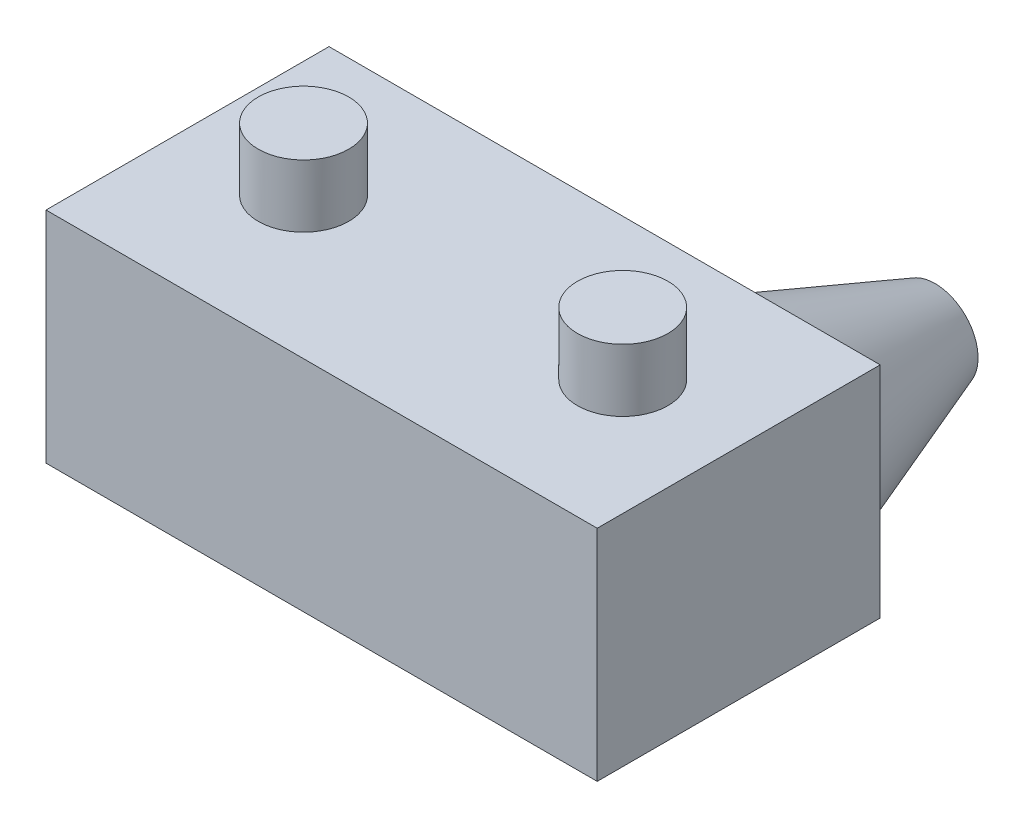
ISO-10303-21;
HEADER;
FILE_DESCRIPTION(('STEP AP214'),'2;1');
FILE_NAME('part.step','',(''),(''),'','','');
FILE_SCHEMA(('AUTOMOTIVE_DESIGN { 1 0 10303 214 1 1 1 1 }'));
ENDSEC;
DATA;
#1=APPLICATION_CONTEXT('core data for automotive mechanical design processes');
#2=APPLICATION_PROTOCOL_DEFINITION('international standard','automotive_design',2000,#1);
#3=PRODUCT_CONTEXT('',#1,'mechanical');
#4=PRODUCT('Part','Part','',(#3));
#5=PRODUCT_RELATED_PRODUCT_CATEGORY('part','',(#4));
#6=PRODUCT_DEFINITION_FORMATION('','',#4);
#7=PRODUCT_DEFINITION_CONTEXT('part definition',#1,'design');
#8=PRODUCT_DEFINITION('design','',#6,#7);
#9=PRODUCT_DEFINITION_SHAPE('','',#8);
#10=(LENGTH_UNIT() NAMED_UNIT(*) SI_UNIT(.MILLI.,.METRE.));
#11=(NAMED_UNIT(*) PLANE_ANGLE_UNIT() SI_UNIT($,.RADIAN.));
#12=(NAMED_UNIT(*) SI_UNIT($,.STERADIAN.) SOLID_ANGLE_UNIT());
#13=UNCERTAINTY_MEASURE_WITH_UNIT(LENGTH_MEASURE(1.E-05),#10,'distance_accuracy_value','');
#14=(GEOMETRIC_REPRESENTATION_CONTEXT(3) GLOBAL_UNCERTAINTY_ASSIGNED_CONTEXT((#13)) GLOBAL_UNIT_ASSIGNED_CONTEXT((#10,
#11,#12)) REPRESENTATION_CONTEXT('',''));
#15=CARTESIAN_POINT('',(0.,0.,0.));
#16=DIRECTION('',(0.,0.,1.));
#17=DIRECTION('',(1.,0.,0.));
#18=AXIS2_PLACEMENT_3D('',#15,#16,#17);
#19=CARTESIAN_POINT('',(-13.4,5.33,6.88));
#20=DIRECTION('',(1.,0.,0.));
#21=DIRECTION('',(0.,1.,0.));
#22=AXIS2_PLACEMENT_3D('',#19,#20,#21);
#23=PLANE('',#22);
#24=DIRECTION('',(0.,-1.,0.));
#25=VECTOR('',#24,1.);
#26=CARTESIAN_POINT('',(-13.4,5.33,0.));
#27=LINE('',#26,#25);
#28=CARTESIAN_POINT('',(-13.4,5.33,0.));
#29=VERTEX_POINT('',#28);
#30=CARTESIAN_POINT('',(-13.4,0.,0.));
#31=VERTEX_POINT('',#30);
#32=EDGE_CURVE('E113',#29,#31,#27,.T.);
#33=ORIENTED_EDGE('',*,*,#32,.T.);
#34=DIRECTION('',(0.,0.,-1.));
#35=VECTOR('',#34,1.);
#36=CARTESIAN_POINT('',(-13.4,0.,6.88));
#37=LINE('',#36,#35);
#38=CARTESIAN_POINT('',(-13.4,0.,6.88));
#39=VERTEX_POINT('',#38);
#40=EDGE_CURVE('E102',#39,#31,#37,.T.);
#41=ORIENTED_EDGE('',*,*,#40,.F.);
#42=DIRECTION('',(0.,-1.,0.));
#43=VECTOR('',#42,1.);
#44=CARTESIAN_POINT('',(-13.4,5.33,6.88));
#45=LINE('',#44,#43);
#46=CARTESIAN_POINT('',(-13.4,5.33,6.88));
#47=VERTEX_POINT('',#46);
#48=EDGE_CURVE('E94',#47,#39,#45,.T.);
#49=ORIENTED_EDGE('',*,*,#48,.F.);
#50=DIRECTION('',(0.,0.,-1.));
#51=VECTOR('',#50,1.);
#52=CARTESIAN_POINT('',(-13.4,5.33,6.88));
#53=LINE('',#52,#51);
#54=EDGE_CURVE('E109',#47,#29,#53,.T.);
#55=ORIENTED_EDGE('',*,*,#54,.T.);
#56=EDGE_LOOP('',(#33,#41,#49,#55));
#57=FACE_BOUND('',#56,.T.);
#58=ADVANCED_FACE('F41',(#57),#23,.F.);
#59=CARTESIAN_POINT('',(-13.4,0.,6.88));
#60=DIRECTION('',(0.,1.,0.));
#61=DIRECTION('',(0.,0.,1.));
#62=AXIS2_PLACEMENT_3D('',#59,#60,#61);
#63=PLANE('',#62);
#64=DIRECTION('',(1.,0.,0.));
#65=VECTOR('',#64,1.);
#66=CARTESIAN_POINT('',(-13.4,0.,0.));
#67=LINE('',#66,#65);
#68=CARTESIAN_POINT('',(0.,0.,0.));
#69=VERTEX_POINT('',#68);
#70=EDGE_CURVE('E100',#31,#69,#67,.T.);
#71=ORIENTED_EDGE('',*,*,#70,.T.);
#72=DIRECTION('',(0.,0.,-1.));
#73=VECTOR('',#72,1.);
#74=CARTESIAN_POINT('',(0.,0.,6.88));
#75=LINE('',#74,#73);
#76=CARTESIAN_POINT('',(0.,0.,6.88));
#77=VERTEX_POINT('',#76);
#78=EDGE_CURVE('E98',#77,#69,#75,.T.);
#79=ORIENTED_EDGE('',*,*,#78,.F.);
#80=DIRECTION('',(1.,0.,0.));
#81=VECTOR('',#80,1.);
#82=CARTESIAN_POINT('',(-13.4,0.,6.88));
#83=LINE('',#82,#81);
#84=EDGE_CURVE('E89',#39,#77,#83,.T.);
#85=ORIENTED_EDGE('',*,*,#84,.F.);
#86=ORIENTED_EDGE('',*,*,#40,.T.);
#87=EDGE_LOOP('',(#71,#79,#85,#86));
#88=FACE_BOUND('',#87,.T.);
#89=ADVANCED_FACE('F99',(#88),#63,.F.);
#90=CARTESIAN_POINT('',(0.,5.33,6.88));
#91=DIRECTION('',(-1.,0.,0.));
#92=DIRECTION('',(0.,0.,1.));
#93=AXIS2_PLACEMENT_3D('',#90,#91,#92);
#94=PLANE('',#93);
#95=DIRECTION('',(0.,1.,0.));
#96=VECTOR('',#95,1.);
#97=CARTESIAN_POINT('',(0.,5.33,0.));
#98=LINE('',#97,#96);
#99=CARTESIAN_POINT('',(0.,5.33,0.));
#100=VERTEX_POINT('',#99);
#101=EDGE_CURVE('E75',#69,#100,#98,.T.);
#102=ORIENTED_EDGE('',*,*,#101,.T.);
#103=DIRECTION('',(0.,0.,-1.));
#104=VECTOR('',#103,1.);
#105=CARTESIAN_POINT('',(0.,5.33,6.88));
#106=LINE('',#105,#104);
#107=CARTESIAN_POINT('',(0.,5.33,6.88));
#108=VERTEX_POINT('',#107);
#109=EDGE_CURVE('E103',#108,#100,#106,.T.);
#110=ORIENTED_EDGE('',*,*,#109,.F.);
#111=DIRECTION('',(0.,1.,0.));
#112=VECTOR('',#111,1.);
#113=CARTESIAN_POINT('',(0.,5.33,6.88));
#114=LINE('',#113,#112);
#115=EDGE_CURVE('E92',#77,#108,#114,.T.);
#116=ORIENTED_EDGE('',*,*,#115,.F.);
#117=ORIENTED_EDGE('',*,*,#78,.T.);
#118=EDGE_LOOP('',(#102,#110,#116,#117));
#119=FACE_BOUND('',#118,.T.);
#120=ADVANCED_FACE('F105',(#119),#94,.F.);
#121=CARTESIAN_POINT('',(-13.4,5.33,6.88));
#122=DIRECTION('',(0.,-1.,0.));
#123=DIRECTION('',(0.,0.,-1.));
#124=AXIS2_PLACEMENT_3D('',#121,#122,#123);
#125=PLANE('',#124);
#126=CARTESIAN_POINT('',(-2.82000000000004,5.33,3.44));
#127=DIRECTION('',(0.,-1.,0.));
#128=DIRECTION('',(0.,0.,-1.));
#129=AXIS2_PLACEMENT_3D('',#126,#127,#128);
#130=CIRCLE('',#129,1.09999999999999);
#131=CARTESIAN_POINT('',(-2.82000000000004,5.33,2.34000000000001));
#132=VERTEX_POINT('',#131);
#133=EDGE_CURVE('E50',#132,#132,#130,.F.);
#134=ORIENTED_EDGE('',*,*,#133,.F.);
#135=EDGE_LOOP('',(#134));
#136=FACE_BOUND('',#135,.T.);
#137=CARTESIAN_POINT('',(-10.58,5.33,3.44));
#138=DIRECTION('',(0.,-1.,0.));
#139=DIRECTION('',(0.,0.,-1.));
#140=AXIS2_PLACEMENT_3D('',#137,#138,#139);
#141=CIRCLE('',#140,1.09999999999999);
#142=CARTESIAN_POINT('',(-10.58,5.33,2.34000000000001));
#143=VERTEX_POINT('',#142);
#144=EDGE_CURVE('E130',#143,#143,#141,.F.);
#145=ORIENTED_EDGE('',*,*,#144,.F.);
#146=EDGE_LOOP('',(#145));
#147=FACE_BOUND('',#146,.T.);
#148=DIRECTION('',(-1.,0.,0.));
#149=VECTOR('',#148,1.);
#150=CARTESIAN_POINT('',(-13.4,5.33,0.));
#151=LINE('',#150,#149);
#152=EDGE_CURVE('E81',#100,#29,#151,.T.);
#153=ORIENTED_EDGE('',*,*,#152,.T.);
#154=ORIENTED_EDGE('',*,*,#54,.F.);
#155=DIRECTION('',(-1.,0.,0.));
#156=VECTOR('',#155,1.);
#157=CARTESIAN_POINT('',(-13.4,5.33,6.88));
#158=LINE('',#157,#156);
#159=EDGE_CURVE('E58',#108,#47,#158,.T.);
#160=ORIENTED_EDGE('',*,*,#159,.F.);
#161=ORIENTED_EDGE('',*,*,#109,.T.);
#162=EDGE_LOOP('',(#153,#154,#160,#161));
#163=FACE_BOUND('',#162,.T.);
#164=ADVANCED_FACE('F139',(#136,#147,#163),#125,.F.);
#165=CARTESIAN_POINT('',(0.,0.,6.88));
#166=DIRECTION('',(0.,0.,1.));
#167=DIRECTION('',(1.,0.,0.));
#168=AXIS2_PLACEMENT_3D('',#165,#166,#167);
#169=PLANE('',#168);
#170=ORIENTED_EDGE('',*,*,#48,.T.);
#171=ORIENTED_EDGE('',*,*,#84,.T.);
#172=ORIENTED_EDGE('',*,*,#115,.T.);
#173=ORIENTED_EDGE('',*,*,#159,.T.);
#174=EDGE_LOOP('',(#170,#171,#172,#173));
#175=FACE_BOUND('',#174,.T.);
#176=ADVANCED_FACE('F90',(#175),#169,.T.);
#177=CARTESIAN_POINT('',(0.,0.,0.));
#178=DIRECTION('',(0.,0.,1.));
#179=DIRECTION('',(1.,0.,0.));
#180=AXIS2_PLACEMENT_3D('',#177,#178,#179);
#181=PLANE('',#180);
#182=CARTESIAN_POINT('',(-2.665,2.665,0.));
#183=DIRECTION('',(0.,0.,1.));
#184=DIRECTION('',(1.,0.,0.));
#185=AXIS2_PLACEMENT_3D('',#182,#183,#184);
#186=CIRCLE('',#185,2.5);
#187=CARTESIAN_POINT('',(-0.165,2.665,0.));
#188=VERTEX_POINT('',#187);
#189=EDGE_CURVE('E11',#188,#188,#186,.F.);
#190=ORIENTED_EDGE('',*,*,#189,.F.);
#191=EDGE_LOOP('',(#190));
#192=FACE_BOUND('',#191,.T.);
#193=ORIENTED_EDGE('',*,*,#32,.F.);
#194=ORIENTED_EDGE('',*,*,#152,.F.);
#195=ORIENTED_EDGE('',*,*,#101,.F.);
#196=ORIENTED_EDGE('',*,*,#70,.F.);
#197=EDGE_LOOP('',(#193,#194,#195,#196));
#198=FACE_BOUND('',#197,.T.);
#199=ADVANCED_FACE('F148',(#192,#198),#181,.F.);
#200=CARTESIAN_POINT('',(-10.58,6.85,3.44));
#201=DIRECTION('',(0.,-1.,0.));
#202=DIRECTION('',(0.,0.,-1.));
#203=AXIS2_PLACEMENT_3D('',#200,#201,#202);
#204=CYLINDRICAL_SURFACE('',#203,1.09999999999999);
#205=CARTESIAN_POINT('',(-10.58,6.85,3.44));
#206=DIRECTION('',(0.,1.,0.));
#207=DIRECTION('',(0.,0.,1.));
#208=AXIS2_PLACEMENT_3D('',#205,#206,#207);
#209=CIRCLE('',#208,1.09999999999999);
#210=CARTESIAN_POINT('',(-10.58,6.85,4.53999999999999));
#211=VERTEX_POINT('',#210);
#212=EDGE_CURVE('E117',#211,#211,#209,.T.);
#213=ORIENTED_EDGE('',*,*,#212,.F.);
#214=EDGE_LOOP('',(#213));
#215=FACE_BOUND('',#214,.T.);
#216=ORIENTED_EDGE('',*,*,#144,.T.);
#217=EDGE_LOOP('',(#216));
#218=FACE_BOUND('',#217,.T.);
#219=ADVANCED_FACE('F145',(#215,#218),#204,.T.);
#220=CARTESIAN_POINT('',(-10.58,6.85,3.44));
#221=DIRECTION('',(0.,1.,0.));
#222=DIRECTION('',(0.,0.,1.));
#223=AXIS2_PLACEMENT_3D('',#220,#221,#222);
#224=PLANE('',#223);
#225=ORIENTED_EDGE('',*,*,#212,.T.);
#226=EDGE_LOOP('',(#225));
#227=FACE_BOUND('',#226,.T.);
#228=ADVANCED_FACE('F147',(#227),#224,.T.);
#229=CARTESIAN_POINT('',(-2.82000000000004,6.85,3.44));
#230=DIRECTION('',(0.,-1.,0.));
#231=DIRECTION('',(0.,0.,-1.));
#232=AXIS2_PLACEMENT_3D('',#229,#230,#231);
#233=CYLINDRICAL_SURFACE('',#232,1.09999999999999);
#234=CARTESIAN_POINT('',(-2.82000000000004,6.85,3.44));
#235=DIRECTION('',(0.,1.,0.));
#236=DIRECTION('',(0.,0.,1.));
#237=AXIS2_PLACEMENT_3D('',#234,#235,#236);
#238=CIRCLE('',#237,1.09999999999999);
#239=CARTESIAN_POINT('',(-2.82000000000004,6.85,4.53999999999999));
#240=VERTEX_POINT('',#239);
#241=EDGE_CURVE('E173',#240,#240,#238,.T.);
#242=ORIENTED_EDGE('',*,*,#241,.F.);
#243=EDGE_LOOP('',(#242));
#244=FACE_BOUND('',#243,.T.);
#245=ORIENTED_EDGE('',*,*,#133,.T.);
#246=EDGE_LOOP('',(#245));
#247=FACE_BOUND('',#246,.T.);
#248=ADVANCED_FACE('F137',(#244,#247),#233,.T.);
#249=CARTESIAN_POINT('',(-2.82000000000004,6.85,3.44));
#250=DIRECTION('',(0.,1.,0.));
#251=DIRECTION('',(0.,0.,1.));
#252=AXIS2_PLACEMENT_3D('',#249,#250,#251);
#253=PLANE('',#252);
#254=ORIENTED_EDGE('',*,*,#241,.T.);
#255=EDGE_LOOP('',(#254));
#256=FACE_BOUND('',#255,.T.);
#257=ADVANCED_FACE('F187',(#256),#253,.T.);
#258=CARTESIAN_POINT('',(-2.665,2.665,0.));
#259=DIRECTION('',(0.,0.,1.));
#260=DIRECTION('',(-1.,0.,0.));
#261=AXIS2_PLACEMENT_3D('',#258,#259,#260);
#262=CONICAL_SURFACE('',#261,2.5,0.349065850398867);
#263=CARTESIAN_POINT('',(-2.665,2.665,-4.));
#264=DIRECTION('',(0.,0.,-1.));
#265=DIRECTION('',(-1.,0.,0.));
#266=AXIS2_PLACEMENT_3D('',#263,#264,#265);
#267=CIRCLE('',#266,1.04411906293519);
#268=CARTESIAN_POINT('',(-3.70911906293519,2.665,-4.));
#269=VERTEX_POINT('',#268);
#270=EDGE_CURVE('E177',#269,#269,#267,.T.);
#271=ORIENTED_EDGE('',*,*,#270,.F.);
#272=EDGE_LOOP('',(#271));
#273=FACE_BOUND('',#272,.T.);
#274=ORIENTED_EDGE('',*,*,#189,.T.);
#275=EDGE_LOOP('',(#274));
#276=FACE_BOUND('',#275,.T.);
#277=ADVANCED_FACE('F184',(#273,#276),#262,.T.);
#278=CARTESIAN_POINT('',(-2.665,2.665,-4.));
#279=DIRECTION('',(0.,0.,-1.));
#280=DIRECTION('',(-1.,0.,0.));
#281=AXIS2_PLACEMENT_3D('',#278,#279,#280);
#282=PLANE('',#281);
#283=ORIENTED_EDGE('',*,*,#270,.T.);
#284=EDGE_LOOP('',(#283));
#285=FACE_BOUND('',#284,.T.);
#286=ADVANCED_FACE('F182',(#285),#282,.T.);
#287=CLOSED_SHELL('',(#58,#89,#120,#164,#176,#199,#219,#228,#248,#257,#277,#286));
#288=MANIFOLD_SOLID_BREP('B2',#287);
#289=ADVANCED_BREP_SHAPE_REPRESENTATION('',(#18,#288),#14);
#290=SHAPE_DEFINITION_REPRESENTATION(#9,#289);
ENDSEC;
END-ISO-10303-21;
